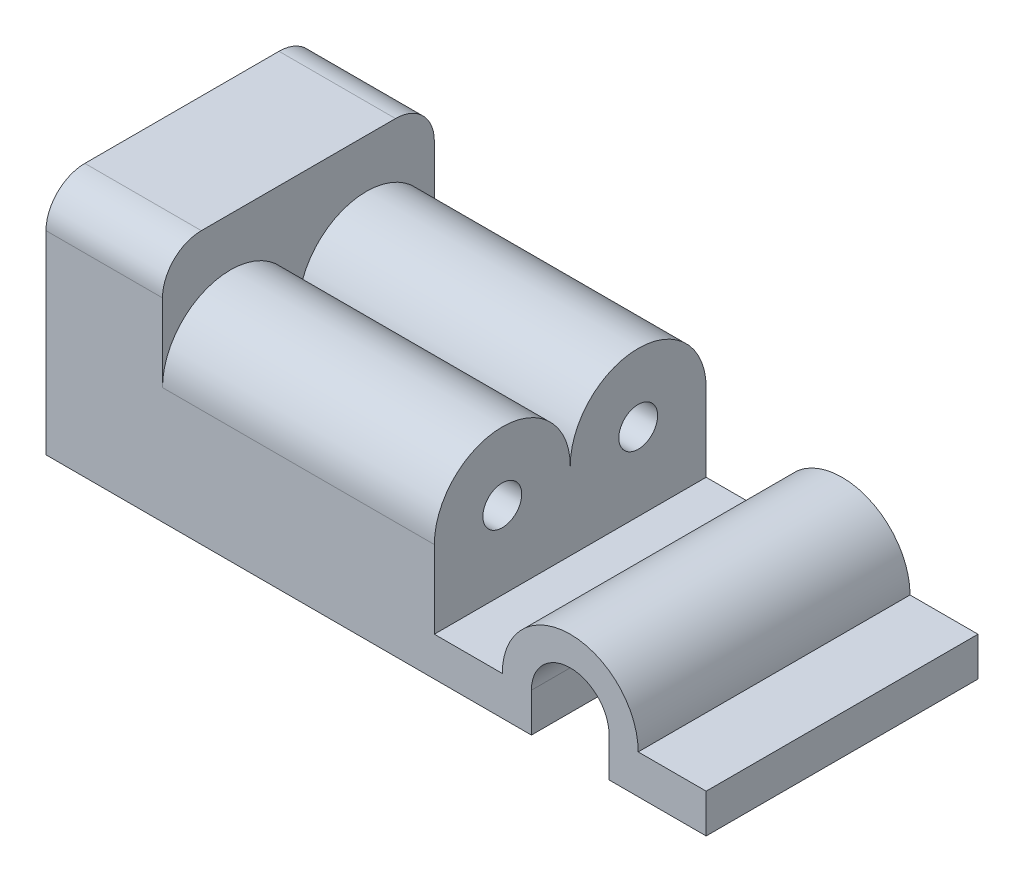
ISO-10303-21;
HEADER;
FILE_DESCRIPTION(('STEP AP214'),'2;1');
FILE_NAME('part.step','',(''),(''),'','','');
FILE_SCHEMA(('AUTOMOTIVE_DESIGN { 1 0 10303 214 1 1 1 1 }'));
ENDSEC;
DATA;
#1=APPLICATION_CONTEXT('core data for automotive mechanical design processes');
#2=APPLICATION_PROTOCOL_DEFINITION('international standard','automotive_design',2000,#1);
#3=PRODUCT_CONTEXT('',#1,'mechanical');
#4=PRODUCT('Part','Part','',(#3));
#5=PRODUCT_RELATED_PRODUCT_CATEGORY('part','',(#4));
#6=PRODUCT_DEFINITION_FORMATION('','',#4);
#7=PRODUCT_DEFINITION_CONTEXT('part definition',#1,'design');
#8=PRODUCT_DEFINITION('design','',#6,#7);
#9=PRODUCT_DEFINITION_SHAPE('','',#8);
#10=(LENGTH_UNIT() NAMED_UNIT(*) SI_UNIT(.MILLI.,.METRE.));
#11=(NAMED_UNIT(*) PLANE_ANGLE_UNIT() SI_UNIT($,.RADIAN.));
#12=(NAMED_UNIT(*) SI_UNIT($,.STERADIAN.) SOLID_ANGLE_UNIT());
#13=UNCERTAINTY_MEASURE_WITH_UNIT(LENGTH_MEASURE(1.E-05),#10,'distance_accuracy_value','');
#14=(GEOMETRIC_REPRESENTATION_CONTEXT(3) GLOBAL_UNCERTAINTY_ASSIGNED_CONTEXT((#13)) GLOBAL_UNIT_ASSIGNED_CONTEXT((#10,
#11,#12)) REPRESENTATION_CONTEXT('',''));
#15=CARTESIAN_POINT('',(0.,0.,0.));
#16=DIRECTION('',(0.,0.,1.));
#17=DIRECTION('',(1.,0.,0.));
#18=AXIS2_PLACEMENT_3D('',#15,#16,#17);
#19=CARTESIAN_POINT('',(-75.1724137931034,-24.3103448275862,35.));
#20=DIRECTION('',(0.,1.,0.));
#21=DIRECTION('',(0.,0.,1.));
#22=AXIS2_PLACEMENT_3D('',#19,#20,#21);
#23=PLANE('',#22);
#24=DIRECTION('',(1.,0.,0.));
#25=VECTOR('',#24,1.);
#26=CARTESIAN_POINT('',(-75.1724137931034,-24.3103448275862,-35.));
#27=LINE('',#26,#25);
#28=CARTESIAN_POINT('',(-75.1724137931034,-24.3103448275862,-35.));
#29=VERTEX_POINT('',#28);
#30=CARTESIAN_POINT('',(49.8275862068966,-24.3103448275862,-35.));
#31=VERTEX_POINT('',#30);
#32=EDGE_CURVE('E254',#29,#31,#27,.T.);
#33=ORIENTED_EDGE('',*,*,#32,.T.);
#34=DIRECTION('',(0.,0.,-1.));
#35=VECTOR('',#34,1.);
#36=CARTESIAN_POINT('',(49.8275862068966,-24.3103448275862,35.));
#37=LINE('',#36,#35);
#38=CARTESIAN_POINT('',(49.8275862068966,-24.3103448275862,35.));
#39=VERTEX_POINT('',#38);
#40=EDGE_CURVE('E210',#39,#31,#37,.T.);
#41=ORIENTED_EDGE('',*,*,#40,.F.);
#42=DIRECTION('',(1.,0.,0.));
#43=VECTOR('',#42,1.);
#44=CARTESIAN_POINT('',(-75.1724137931034,-24.3103448275862,35.));
#45=LINE('',#44,#43);
#46=CARTESIAN_POINT('',(-75.1724137931034,-24.3103448275862,35.));
#47=VERTEX_POINT('',#46);
#48=EDGE_CURVE('E173',#47,#39,#45,.T.);
#49=ORIENTED_EDGE('',*,*,#48,.F.);
#50=DIRECTION('',(0.,0.,-1.));
#51=VECTOR('',#50,1.);
#52=CARTESIAN_POINT('',(-75.1724137931034,-24.3103448275862,35.));
#53=LINE('',#52,#51);
#54=EDGE_CURVE('E177',#47,#29,#53,.T.);
#55=ORIENTED_EDGE('',*,*,#54,.T.);
#56=EDGE_LOOP('',(#33,#41,#49,#55));
#57=FACE_BOUND('',#56,.T.);
#58=ADVANCED_FACE('F33',(#57),#23,.F.);
#59=CARTESIAN_POINT('',(49.8275862068966,-14.3010596020905,35.));
#60=DIRECTION('',(-1.,0.,0.));
#61=DIRECTION('',(0.,0.,1.));
#62=AXIS2_PLACEMENT_3D('',#59,#60,#61);
#63=PLANE('',#62);
#64=DIRECTION('',(0.,1.,0.));
#65=VECTOR('',#64,1.);
#66=CARTESIAN_POINT('',(49.8275862068966,-14.3010596020905,-35.));
#67=LINE('',#66,#65);
#68=CARTESIAN_POINT('',(49.8275862068966,-14.3010596020905,-35.));
#69=VERTEX_POINT('',#68);
#70=EDGE_CURVE('E257',#31,#69,#67,.T.);
#71=ORIENTED_EDGE('',*,*,#70,.T.);
#72=DIRECTION('',(0.,0.,-1.));
#73=VECTOR('',#72,1.);
#74=CARTESIAN_POINT('',(49.8275862068966,-14.3010596020905,35.));
#75=LINE('',#74,#73);
#76=CARTESIAN_POINT('',(49.8275862068966,-14.3010596020905,35.));
#77=VERTEX_POINT('',#76);
#78=EDGE_CURVE('E207',#77,#69,#75,.T.);
#79=ORIENTED_EDGE('',*,*,#78,.F.);
#80=DIRECTION('',(0.,1.,0.));
#81=VECTOR('',#80,1.);
#82=CARTESIAN_POINT('',(49.8275862068966,-14.3010596020905,35.));
#83=LINE('',#82,#81);
#84=EDGE_CURVE('E322',#39,#77,#83,.T.);
#85=ORIENTED_EDGE('',*,*,#84,.F.);
#86=ORIENTED_EDGE('',*,*,#40,.T.);
#87=EDGE_LOOP('',(#71,#79,#85,#86));
#88=FACE_BOUND('',#87,.T.);
#89=ADVANCED_FACE('F321',(#88),#63,.F.);
#90=CARTESIAN_POINT('',(59.8275862068966,-14.3010596020905,35.));
#91=DIRECTION('',(0.,0.,-1.));
#92=DIRECTION('',(-1.,0.,0.));
#93=AXIS2_PLACEMENT_3D('',#90,#91,#92);
#94=CYLINDRICAL_SURFACE('',#93,9.99999999999999);
#95=CARTESIAN_POINT('',(59.8275862068966,-14.3010596020905,-35.));
#96=DIRECTION('',(0.,0.,-1.));
#97=DIRECTION('',(1.,0.,0.));
#98=AXIS2_PLACEMENT_3D('',#95,#96,#97);
#99=CIRCLE('',#98,9.99999999999999);
#100=CARTESIAN_POINT('',(69.8275862068966,-14.3010596020905,-35.));
#101=VERTEX_POINT('',#100);
#102=EDGE_CURVE('E260',#69,#101,#99,.T.);
#103=ORIENTED_EDGE('',*,*,#102,.T.);
#104=DIRECTION('',(0.,0.,-1.));
#105=VECTOR('',#104,1.);
#106=CARTESIAN_POINT('',(69.8275862068966,-14.3010596020905,35.));
#107=LINE('',#106,#105);
#108=CARTESIAN_POINT('',(69.8275862068966,-14.3010596020905,35.));
#109=VERTEX_POINT('',#108);
#110=EDGE_CURVE('E204',#109,#101,#107,.T.);
#111=ORIENTED_EDGE('',*,*,#110,.F.);
#112=CARTESIAN_POINT('',(59.8275862068966,-14.3010596020905,35.));
#113=DIRECTION('',(0.,0.,-1.));
#114=DIRECTION('',(1.,0.,0.));
#115=AXIS2_PLACEMENT_3D('',#112,#113,#114);
#116=CIRCLE('',#115,9.99999999999999);
#117=EDGE_CURVE('E319',#77,#109,#116,.T.);
#118=ORIENTED_EDGE('',*,*,#117,.F.);
#119=ORIENTED_EDGE('',*,*,#78,.T.);
#120=EDGE_LOOP('',(#103,#111,#118,#119));
#121=FACE_BOUND('',#120,.T.);
#122=ADVANCED_FACE('F316',(#121),#94,.F.);
#123=CARTESIAN_POINT('',(69.8275862068966,-24.3103448275862,35.));
#124=DIRECTION('',(1.,0.,0.));
#125=DIRECTION('',(0.,0.,-1.));
#126=AXIS2_PLACEMENT_3D('',#123,#124,#125);
#127=PLANE('',#126);
#128=DIRECTION('',(0.,-1.,0.));
#129=VECTOR('',#128,1.);
#130=CARTESIAN_POINT('',(69.8275862068966,-24.3103448275862,-35.));
#131=LINE('',#130,#129);
#132=CARTESIAN_POINT('',(69.8275862068966,-24.3103448275862,-35.));
#133=VERTEX_POINT('',#132);
#134=EDGE_CURVE('E262',#101,#133,#131,.T.);
#135=ORIENTED_EDGE('',*,*,#134,.T.);
#136=DIRECTION('',(0.,0.,-1.));
#137=VECTOR('',#136,1.);
#138=CARTESIAN_POINT('',(69.8275862068966,-24.3103448275862,35.));
#139=LINE('',#138,#137);
#140=CARTESIAN_POINT('',(69.8275862068966,-24.3103448275862,35.));
#141=VERTEX_POINT('',#140);
#142=EDGE_CURVE('E201',#141,#133,#139,.T.);
#143=ORIENTED_EDGE('',*,*,#142,.F.);
#144=DIRECTION('',(0.,-1.,0.));
#145=VECTOR('',#144,1.);
#146=CARTESIAN_POINT('',(69.8275862068966,-24.3103448275862,35.));
#147=LINE('',#146,#145);
#148=EDGE_CURVE('E311',#109,#141,#147,.T.);
#149=ORIENTED_EDGE('',*,*,#148,.F.);
#150=ORIENTED_EDGE('',*,*,#110,.T.);
#151=EDGE_LOOP('',(#135,#143,#149,#150));
#152=FACE_BOUND('',#151,.T.);
#153=ADVANCED_FACE('F310',(#152),#127,.F.);
#154=CARTESIAN_POINT('',(94.8275862068966,-24.3103448275862,35.));
#155=DIRECTION('',(0.,1.,0.));
#156=DIRECTION('',(0.,0.,1.));
#157=AXIS2_PLACEMENT_3D('',#154,#155,#156);
#158=PLANE('',#157);
#159=DIRECTION('',(1.,0.,0.));
#160=VECTOR('',#159,1.);
#161=CARTESIAN_POINT('',(94.8275862068966,-24.3103448275862,-35.));
#162=LINE('',#161,#160);
#163=CARTESIAN_POINT('',(94.8275862068966,-24.3103448275862,-35.));
#164=VERTEX_POINT('',#163);
#165=EDGE_CURVE('E264',#133,#164,#162,.T.);
#166=ORIENTED_EDGE('',*,*,#165,.T.);
#167=DIRECTION('',(0.,0.,-1.));
#168=VECTOR('',#167,1.);
#169=CARTESIAN_POINT('',(94.8275862068966,-24.3103448275862,35.));
#170=LINE('',#169,#168);
#171=CARTESIAN_POINT('',(94.8275862068966,-24.3103448275862,35.));
#172=VERTEX_POINT('',#171);
#173=EDGE_CURVE('E198',#172,#164,#170,.T.);
#174=ORIENTED_EDGE('',*,*,#173,.F.);
#175=DIRECTION('',(1.,0.,0.));
#176=VECTOR('',#175,1.);
#177=CARTESIAN_POINT('',(94.8275862068966,-24.3103448275862,35.));
#178=LINE('',#177,#176);
#179=EDGE_CURVE('E306',#141,#172,#178,.T.);
#180=ORIENTED_EDGE('',*,*,#179,.F.);
#181=ORIENTED_EDGE('',*,*,#142,.T.);
#182=EDGE_LOOP('',(#166,#174,#180,#181));
#183=FACE_BOUND('',#182,.T.);
#184=ADVANCED_FACE('F305',(#183),#158,.F.);
#185=CARTESIAN_POINT('',(94.8275862068966,-14.3103448275862,35.));
#186=DIRECTION('',(-1.,0.,0.));
#187=DIRECTION('',(0.,0.,1.));
#188=AXIS2_PLACEMENT_3D('',#185,#186,#187);
#189=PLANE('',#188);
#190=DIRECTION('',(0.,1.,0.));
#191=VECTOR('',#190,1.);
#192=CARTESIAN_POINT('',(94.8275862068966,-14.3103448275862,-35.));
#193=LINE('',#192,#191);
#194=CARTESIAN_POINT('',(94.8275862068966,-14.3103448275862,-35.));
#195=VERTEX_POINT('',#194);
#196=EDGE_CURVE('E266',#164,#195,#193,.T.);
#197=ORIENTED_EDGE('',*,*,#196,.T.);
#198=DIRECTION('',(0.,0.,-1.));
#199=VECTOR('',#198,1.);
#200=CARTESIAN_POINT('',(94.8275862068966,-14.3103448275862,35.));
#201=LINE('',#200,#199);
#202=CARTESIAN_POINT('',(94.8275862068966,-14.3103448275862,35.));
#203=VERTEX_POINT('',#202);
#204=EDGE_CURVE('E195',#203,#195,#201,.T.);
#205=ORIENTED_EDGE('',*,*,#204,.F.);
#206=DIRECTION('',(0.,1.,0.));
#207=VECTOR('',#206,1.);
#208=CARTESIAN_POINT('',(94.8275862068966,-14.3103448275862,35.));
#209=LINE('',#208,#207);
#210=EDGE_CURVE('E302',#172,#203,#209,.T.);
#211=ORIENTED_EDGE('',*,*,#210,.F.);
#212=ORIENTED_EDGE('',*,*,#173,.T.);
#213=EDGE_LOOP('',(#197,#205,#211,#212));
#214=FACE_BOUND('',#213,.T.);
#215=ADVANCED_FACE('F299',(#214),#189,.F.);
#216=CARTESIAN_POINT('',(77.3275837435989,-14.3103448275862,35.));
#217=DIRECTION('',(0.,-1.,0.));
#218=DIRECTION('',(0.,0.,-1.));
#219=AXIS2_PLACEMENT_3D('',#216,#217,#218);
#220=PLANE('',#219);
#221=DIRECTION('',(-1.,0.,0.));
#222=VECTOR('',#221,1.);
#223=CARTESIAN_POINT('',(77.3275837435989,-14.3103448275862,-35.));
#224=LINE('',#223,#222);
#225=CARTESIAN_POINT('',(77.3275837435989,-14.3103448275862,-35.));
#226=VERTEX_POINT('',#225);
#227=EDGE_CURVE('E268',#195,#226,#224,.T.);
#228=ORIENTED_EDGE('',*,*,#227,.T.);
#229=DIRECTION('',(0.,0.,-1.));
#230=VECTOR('',#229,1.);
#231=CARTESIAN_POINT('',(77.3275837435989,-14.3103448275862,35.));
#232=LINE('',#231,#230);
#233=CARTESIAN_POINT('',(77.3275837435989,-14.3103448275862,35.));
#234=VERTEX_POINT('',#233);
#235=EDGE_CURVE('E192',#234,#226,#232,.T.);
#236=ORIENTED_EDGE('',*,*,#235,.F.);
#237=DIRECTION('',(-1.,0.,0.));
#238=VECTOR('',#237,1.);
#239=CARTESIAN_POINT('',(77.3275837435989,-14.3103448275862,35.));
#240=LINE('',#239,#238);
#241=EDGE_CURVE('E293',#203,#234,#240,.T.);
#242=ORIENTED_EDGE('',*,*,#241,.F.);
#243=ORIENTED_EDGE('',*,*,#204,.T.);
#244=EDGE_LOOP('',(#228,#236,#242,#243));
#245=FACE_BOUND('',#244,.T.);
#246=ADVANCED_FACE('F292',(#245),#220,.F.);
#247=CARTESIAN_POINT('',(59.8275862068966,-14.3010596020905,35.));
#248=DIRECTION('',(0.,0.,-1.));
#249=DIRECTION('',(-1.,0.,0.));
#250=AXIS2_PLACEMENT_3D('',#247,#248,#249);
#251=CYLINDRICAL_SURFACE('',#250,17.5);
#252=CARTESIAN_POINT('',(59.8275862068966,-14.3010596020905,-35.));
#253=DIRECTION('',(0.,0.,1.));
#254=DIRECTION('',(-1.,0.,0.));
#255=AXIS2_PLACEMENT_3D('',#252,#253,#254);
#256=CIRCLE('',#255,17.5);
#257=CARTESIAN_POINT('',(42.3275886701942,-14.3103448275862,-35.));
#258=VERTEX_POINT('',#257);
#259=EDGE_CURVE('E270',#226,#258,#256,.T.);
#260=ORIENTED_EDGE('',*,*,#259,.T.);
#261=DIRECTION('',(0.,0.,-1.));
#262=VECTOR('',#261,1.);
#263=CARTESIAN_POINT('',(42.3275886701942,-14.3103448275862,35.));
#264=LINE('',#263,#262);
#265=CARTESIAN_POINT('',(42.3275886701942,-14.3103448275862,35.));
#266=VERTEX_POINT('',#265);
#267=EDGE_CURVE('E189',#266,#258,#264,.T.);
#268=ORIENTED_EDGE('',*,*,#267,.F.);
#269=CARTESIAN_POINT('',(59.8275862068966,-14.3010596020905,35.));
#270=DIRECTION('',(0.,0.,1.));
#271=DIRECTION('',(-1.,0.,0.));
#272=AXIS2_PLACEMENT_3D('',#269,#270,#271);
#273=CIRCLE('',#272,17.5);
#274=EDGE_CURVE('E288',#234,#266,#273,.T.);
#275=ORIENTED_EDGE('',*,*,#274,.F.);
#276=ORIENTED_EDGE('',*,*,#235,.T.);
#277=EDGE_LOOP('',(#260,#268,#275,#276));
#278=FACE_BOUND('',#277,.T.);
#279=ADVANCED_FACE('F287',(#278),#251,.T.);
#280=CARTESIAN_POINT('',(24.8275862068966,-14.3103448275862,35.));
#281=DIRECTION('',(0.,-1.,0.));
#282=DIRECTION('',(1.,0.,0.));
#283=AXIS2_PLACEMENT_3D('',#280,#281,#282);
#284=PLANE('',#283);
#285=DIRECTION('',(-1.,0.,0.));
#286=VECTOR('',#285,1.);
#287=CARTESIAN_POINT('',(24.8275862068966,-14.3103448275862,-35.));
#288=LINE('',#287,#286);
#289=CARTESIAN_POINT('',(24.8275862068966,-14.3103448275862,-35.));
#290=VERTEX_POINT('',#289);
#291=EDGE_CURVE('E272',#258,#290,#288,.T.);
#292=ORIENTED_EDGE('',*,*,#291,.T.);
#293=DIRECTION('',(0.,0.,-1.));
#294=VECTOR('',#293,1.);
#295=CARTESIAN_POINT('',(24.8275862068966,-14.3103448275862,35.));
#296=LINE('',#295,#294);
#297=CARTESIAN_POINT('',(24.8275862068966,-14.3103448275862,35.));
#298=VERTEX_POINT('',#297);
#299=EDGE_CURVE('E186',#298,#290,#296,.T.);
#300=ORIENTED_EDGE('',*,*,#299,.F.);
#301=DIRECTION('',(-1.,0.,0.));
#302=VECTOR('',#301,1.);
#303=CARTESIAN_POINT('',(24.8275862068966,-14.3103448275862,35.));
#304=LINE('',#303,#302);
#305=EDGE_CURVE('E284',#266,#298,#304,.T.);
#306=ORIENTED_EDGE('',*,*,#305,.F.);
#307=ORIENTED_EDGE('',*,*,#267,.T.);
#308=EDGE_LOOP('',(#292,#300,#306,#307));
#309=FACE_BOUND('',#308,.T.);
#310=ADVANCED_FACE('F281',(#309),#284,.F.);
#311=CARTESIAN_POINT('',(24.8275862068966,5.68965517241379,35.));
#312=DIRECTION('',(-1.,0.,0.));
#313=DIRECTION('',(0.,-1.,0.));
#314=AXIS2_PLACEMENT_3D('',#311,#312,#313);
#315=PLANE('',#314);
#316=CARTESIAN_POINT('',(24.8275862068966,5.6896551724138,-17.5));
#317=DIRECTION('',(1.,0.,0.));
#318=DIRECTION('',(0.,1.,0.));
#319=AXIS2_PLACEMENT_3D('',#316,#317,#318);
#320=CIRCLE('',#319,5.);
#321=CARTESIAN_POINT('',(24.8275862068966,10.6896551724138,-17.5));
#322=VERTEX_POINT('',#321);
#323=EDGE_CURVE('E391',#322,#322,#320,.T.);
#324=ORIENTED_EDGE('',*,*,#323,.F.);
#325=EDGE_LOOP('',(#324));
#326=FACE_BOUND('',#325,.T.);
#327=CARTESIAN_POINT('',(24.8275862068966,5.6896551724138,17.5));
#328=DIRECTION('',(1.,0.,0.));
#329=DIRECTION('',(0.,1.,0.));
#330=AXIS2_PLACEMENT_3D('',#327,#328,#329);
#331=CIRCLE('',#330,5.);
#332=CARTESIAN_POINT('',(24.8275862068966,10.6896551724138,17.5));
#333=VERTEX_POINT('',#332);
#334=EDGE_CURVE('E390',#333,#333,#331,.T.);
#335=ORIENTED_EDGE('',*,*,#334,.F.);
#336=EDGE_LOOP('',(#335));
#337=FACE_BOUND('',#336,.T.);
#338=DIRECTION('',(0.,1.,0.));
#339=VECTOR('',#338,1.);
#340=CARTESIAN_POINT('',(24.8275862068966,5.68965517241379,-35.));
#341=LINE('',#340,#339);
#342=CARTESIAN_POINT('',(24.8275862068966,5.68965517241379,-35.));
#343=VERTEX_POINT('',#342);
#344=EDGE_CURVE('E160',#290,#343,#341,.T.);
#345=ORIENTED_EDGE('',*,*,#344,.T.);
#346=CARTESIAN_POINT('',(24.8275862068966,5.68965517241379,-17.5));
#347=DIRECTION('',(1.,0.,0.));
#348=DIRECTION('',(0.,0.,-1.));
#349=AXIS2_PLACEMENT_3D('',#346,#347,#348);
#350=CIRCLE('',#349,17.5);
#351=CARTESIAN_POINT('',(24.8275862068966,5.68965517241379,0.));
#352=VERTEX_POINT('',#351);
#353=EDGE_CURVE('E156',#343,#352,#350,.T.);
#354=ORIENTED_EDGE('',*,*,#353,.T.);
#355=CARTESIAN_POINT('',(24.8275862068966,5.68965517241379,17.5));
#356=DIRECTION('',(1.,0.,0.));
#357=DIRECTION('',(0.,0.,-1.));
#358=AXIS2_PLACEMENT_3D('',#355,#356,#357);
#359=CIRCLE('',#358,17.5);
#360=CARTESIAN_POINT('',(24.8275862068966,5.68965517241379,35.));
#361=VERTEX_POINT('',#360);
#362=EDGE_CURVE('E401',#352,#361,#359,.T.);
#363=ORIENTED_EDGE('',*,*,#362,.T.);
#364=DIRECTION('',(0.,1.,0.));
#365=VECTOR('',#364,1.);
#366=CARTESIAN_POINT('',(24.8275862068966,5.68965517241379,35.));
#367=LINE('',#366,#365);
#368=EDGE_CURVE('E250',#298,#361,#367,.T.);
#369=ORIENTED_EDGE('',*,*,#368,.F.);
#370=ORIENTED_EDGE('',*,*,#299,.T.);
#371=EDGE_LOOP('',(#345,#354,#363,#369,#370));
#372=FACE_BOUND('',#371,.T.);
#373=ADVANCED_FACE('F274',(#326,#337,#372),#315,.F.);
#374=CARTESIAN_POINT('',(-45.1724137931034,35.6896551724138,35.));
#375=DIRECTION('',(-1.,0.,0.));
#376=DIRECTION('',(0.,0.,1.));
#377=AXIS2_PLACEMENT_3D('',#374,#375,#376);
#378=PLANE('',#377);
#379=CARTESIAN_POINT('',(-45.1724137931034,5.68965517241379,-17.5));
#380=DIRECTION('',(1.,0.,0.));
#381=DIRECTION('',(0.,0.,-1.));
#382=AXIS2_PLACEMENT_3D('',#379,#380,#381);
#383=CIRCLE('',#382,17.5);
#384=CARTESIAN_POINT('',(-45.1724137931034,5.68965517241379,-35.));
#385=VERTEX_POINT('',#384);
#386=CARTESIAN_POINT('',(-45.1724137931034,5.68965517241379,0.));
#387=VERTEX_POINT('',#386);
#388=EDGE_CURVE('E154',#385,#387,#383,.T.);
#389=ORIENTED_EDGE('',*,*,#388,.F.);
#390=DIRECTION('',(0.,1.,0.));
#391=VECTOR('',#390,1.);
#392=CARTESIAN_POINT('',(-45.1724137931034,35.6896551724138,-35.));
#393=LINE('',#392,#391);
#394=CARTESIAN_POINT('',(-45.1724137931034,25.6896551724138,-35.));
#395=VERTEX_POINT('',#394);
#396=EDGE_CURVE('E159',#385,#395,#393,.T.);
#397=ORIENTED_EDGE('',*,*,#396,.T.);
#398=CARTESIAN_POINT('',(-45.1724137931034,25.6896551724138,-25.));
#399=DIRECTION('',(-1.,0.,0.));
#400=DIRECTION('',(0.,0.,1.));
#401=AXIS2_PLACEMENT_3D('',#398,#399,#400);
#402=CIRCLE('',#401,10.);
#403=CARTESIAN_POINT('',(-45.1724137931034,35.6896551724138,-25.));
#404=VERTEX_POINT('',#403);
#405=EDGE_CURVE('E11',#395,#404,#402,.F.);
#406=ORIENTED_EDGE('',*,*,#405,.T.);
#407=DIRECTION('',(0.,0.,-1.));
#408=VECTOR('',#407,1.);
#409=CARTESIAN_POINT('',(-45.1724137931034,35.6896551724138,35.));
#410=LINE('',#409,#408);
#411=CARTESIAN_POINT('',(-45.1724137931034,35.6896551724138,25.));
#412=VERTEX_POINT('',#411);
#413=EDGE_CURVE('E183',#412,#404,#410,.T.);
#414=ORIENTED_EDGE('',*,*,#413,.F.);
#415=CARTESIAN_POINT('',(-45.1724137931034,25.6896551724138,25.));
#416=DIRECTION('',(-1.,0.,0.));
#417=DIRECTION('',(0.,0.,1.));
#418=AXIS2_PLACEMENT_3D('',#415,#416,#417);
#419=CIRCLE('',#418,10.);
#420=CARTESIAN_POINT('',(-45.1724137931034,25.6896551724138,35.));
#421=VERTEX_POINT('',#420);
#422=EDGE_CURVE('E220',#412,#421,#419,.F.);
#423=ORIENTED_EDGE('',*,*,#422,.T.);
#424=DIRECTION('',(0.,1.,0.));
#425=VECTOR('',#424,1.);
#426=CARTESIAN_POINT('',(-45.1724137931034,35.6896551724138,35.));
#427=LINE('',#426,#425);
#428=CARTESIAN_POINT('',(-45.1724137931034,5.68965517241379,35.));
#429=VERTEX_POINT('',#428);
#430=EDGE_CURVE('E244',#429,#421,#427,.T.);
#431=ORIENTED_EDGE('',*,*,#430,.F.);
#432=CARTESIAN_POINT('',(-45.1724137931034,5.68965517241379,17.5));
#433=DIRECTION('',(1.,0.,0.));
#434=DIRECTION('',(0.,0.,-1.));
#435=AXIS2_PLACEMENT_3D('',#432,#433,#434);
#436=CIRCLE('',#435,17.5);
#437=EDGE_CURVE('E167',#387,#429,#436,.T.);
#438=ORIENTED_EDGE('',*,*,#437,.F.);
#439=EDGE_LOOP('',(#389,#397,#406,#414,#423,#431,#438));
#440=FACE_BOUND('',#439,.T.);
#441=ADVANCED_FACE('F164',(#440),#378,.F.);
#442=CARTESIAN_POINT('',(-75.1724137931034,35.6896551724138,35.));
#443=DIRECTION('',(0.,-1.,0.));
#444=DIRECTION('',(0.,0.,-1.));
#445=AXIS2_PLACEMENT_3D('',#442,#443,#444);
#446=PLANE('',#445);
#447=ORIENTED_EDGE('',*,*,#413,.T.);
#448=DIRECTION('',(-1.,0.,0.));
#449=VECTOR('',#448,1.);
#450=CARTESIAN_POINT('',(-75.1724137931034,35.6896551724138,-25.));
#451=LINE('',#450,#449);
#452=CARTESIAN_POINT('',(-75.1724137931034,35.6896551724138,-25.));
#453=VERTEX_POINT('',#452);
#454=EDGE_CURVE('E222',#404,#453,#451,.T.);
#455=ORIENTED_EDGE('',*,*,#454,.T.);
#456=DIRECTION('',(0.,0.,-1.));
#457=VECTOR('',#456,1.);
#458=CARTESIAN_POINT('',(-75.1724137931034,35.6896551724138,35.));
#459=LINE('',#458,#457);
#460=CARTESIAN_POINT('',(-75.1724137931034,35.6896551724138,25.));
#461=VERTEX_POINT('',#460);
#462=EDGE_CURVE('E180',#461,#453,#459,.T.);
#463=ORIENTED_EDGE('',*,*,#462,.F.);
#464=DIRECTION('',(-1.,0.,0.));
#465=VECTOR('',#464,1.);
#466=CARTESIAN_POINT('',(-45.1724137931034,35.6896551724138,25.));
#467=LINE('',#466,#465);
#468=EDGE_CURVE('E218',#461,#412,#467,.F.);
#469=ORIENTED_EDGE('',*,*,#468,.T.);
#470=EDGE_LOOP('',(#447,#455,#463,#469));
#471=FACE_BOUND('',#470,.T.);
#472=ADVANCED_FACE('F228',(#471),#446,.F.);
#473=CARTESIAN_POINT('',(-75.1724137931034,-24.3103448275862,35.));
#474=DIRECTION('',(1.,0.,0.));
#475=DIRECTION('',(0.,0.,-1.));
#476=AXIS2_PLACEMENT_3D('',#473,#474,#475);
#477=PLANE('',#476);
#478=ORIENTED_EDGE('',*,*,#462,.T.);
#479=CARTESIAN_POINT('',(-75.1724137931034,25.6896551724138,-25.));
#480=DIRECTION('',(1.,0.,0.));
#481=DIRECTION('',(0.,0.,-1.));
#482=AXIS2_PLACEMENT_3D('',#479,#480,#481);
#483=CIRCLE('',#482,10.);
#484=CARTESIAN_POINT('',(-75.1724137931034,25.6896551724138,-35.));
#485=VERTEX_POINT('',#484);
#486=EDGE_CURVE('E55',#453,#485,#483,.F.);
#487=ORIENTED_EDGE('',*,*,#486,.T.);
#488=DIRECTION('',(0.,-1.,0.));
#489=VECTOR('',#488,1.);
#490=CARTESIAN_POINT('',(-75.1724137931034,-24.3103448275862,-35.));
#491=LINE('',#490,#489);
#492=EDGE_CURVE('E171',#485,#29,#491,.T.);
#493=ORIENTED_EDGE('',*,*,#492,.T.);
#494=ORIENTED_EDGE('',*,*,#54,.F.);
#495=DIRECTION('',(0.,-1.,0.));
#496=VECTOR('',#495,1.);
#497=CARTESIAN_POINT('',(-75.1724137931034,-24.3103448275862,35.));
#498=LINE('',#497,#496);
#499=CARTESIAN_POINT('',(-75.1724137931034,25.6896551724138,35.));
#500=VERTEX_POINT('',#499);
#501=EDGE_CURVE('E181',#500,#47,#498,.T.);
#502=ORIENTED_EDGE('',*,*,#501,.F.);
#503=CARTESIAN_POINT('',(-75.1724137931034,25.6896551724138,25.));
#504=DIRECTION('',(1.,0.,0.));
#505=DIRECTION('',(0.,0.,-1.));
#506=AXIS2_PLACEMENT_3D('',#503,#504,#505);
#507=CIRCLE('',#506,10.);
#508=EDGE_CURVE('E216',#500,#461,#507,.F.);
#509=ORIENTED_EDGE('',*,*,#508,.T.);
#510=EDGE_LOOP('',(#478,#487,#493,#494,#502,#509));
#511=FACE_BOUND('',#510,.T.);
#512=ADVANCED_FACE('F232',(#511),#477,.F.);
#513=CARTESIAN_POINT('',(59.8275862068966,-14.3010596020905,35.));
#514=DIRECTION('',(0.,0.,1.));
#515=DIRECTION('',(1.,0.,0.));
#516=AXIS2_PLACEMENT_3D('',#513,#514,#515);
#517=PLANE('',#516);
#518=ORIENTED_EDGE('',*,*,#430,.T.);
#519=DIRECTION('',(-1.,0.,0.));
#520=VECTOR('',#519,1.);
#521=CARTESIAN_POINT('',(-75.1724137931034,25.6896551724138,35.));
#522=LINE('',#521,#520);
#523=EDGE_CURVE('E213',#421,#500,#522,.T.);
#524=ORIENTED_EDGE('',*,*,#523,.T.);
#525=ORIENTED_EDGE('',*,*,#501,.T.);
#526=ORIENTED_EDGE('',*,*,#48,.T.);
#527=ORIENTED_EDGE('',*,*,#84,.T.);
#528=ORIENTED_EDGE('',*,*,#117,.T.);
#529=ORIENTED_EDGE('',*,*,#148,.T.);
#530=ORIENTED_EDGE('',*,*,#179,.T.);
#531=ORIENTED_EDGE('',*,*,#210,.T.);
#532=ORIENTED_EDGE('',*,*,#241,.T.);
#533=ORIENTED_EDGE('',*,*,#274,.T.);
#534=ORIENTED_EDGE('',*,*,#305,.T.);
#535=ORIENTED_EDGE('',*,*,#368,.T.);
#536=DIRECTION('',(-1.,0.,0.));
#537=VECTOR('',#536,1.);
#538=CARTESIAN_POINT('',(-45.1724137931034,5.68965517241379,35.));
#539=LINE('',#538,#537);
#540=EDGE_CURVE('E247',#361,#429,#539,.T.);
#541=ORIENTED_EDGE('',*,*,#540,.T.);
#542=EDGE_LOOP('',(#518,#524,#525,#526,#527,#528,#529,#530,#531,#532,#533,#534,#535,#541));
#543=FACE_BOUND('',#542,.T.);
#544=ADVANCED_FACE('F241',(#543),#517,.T.);
#545=CARTESIAN_POINT('',(59.8275862068966,-14.3010596020905,-35.));
#546=DIRECTION('',(0.,0.,1.));
#547=DIRECTION('',(1.,0.,0.));
#548=AXIS2_PLACEMENT_3D('',#545,#546,#547);
#549=PLANE('',#548);
#550=ORIENTED_EDGE('',*,*,#492,.F.);
#551=DIRECTION('',(-1.,0.,0.));
#552=VECTOR('',#551,1.);
#553=CARTESIAN_POINT('',(59.8275862068966,25.6896551724138,-35.));
#554=LINE('',#553,#552);
#555=EDGE_CURVE('E41',#485,#395,#554,.F.);
#556=ORIENTED_EDGE('',*,*,#555,.T.);
#557=ORIENTED_EDGE('',*,*,#396,.F.);
#558=DIRECTION('',(-1.,0.,0.));
#559=VECTOR('',#558,1.);
#560=CARTESIAN_POINT('',(-45.1724137931034,5.68965517241379,-35.));
#561=LINE('',#560,#559);
#562=EDGE_CURVE('E150',#343,#385,#561,.T.);
#563=ORIENTED_EDGE('',*,*,#562,.F.);
#564=ORIENTED_EDGE('',*,*,#344,.F.);
#565=ORIENTED_EDGE('',*,*,#291,.F.);
#566=ORIENTED_EDGE('',*,*,#259,.F.);
#567=ORIENTED_EDGE('',*,*,#227,.F.);
#568=ORIENTED_EDGE('',*,*,#196,.F.);
#569=ORIENTED_EDGE('',*,*,#165,.F.);
#570=ORIENTED_EDGE('',*,*,#134,.F.);
#571=ORIENTED_EDGE('',*,*,#102,.F.);
#572=ORIENTED_EDGE('',*,*,#70,.F.);
#573=ORIENTED_EDGE('',*,*,#32,.F.);
#574=EDGE_LOOP('',(#550,#556,#557,#563,#564,#565,#566,#567,#568,#569,#570,#571,#572,#573));
#575=FACE_BOUND('',#574,.T.);
#576=ADVANCED_FACE('F170',(#575),#549,.F.);
#577=CARTESIAN_POINT('',(59.8275862068966,25.6896551724138,25.));
#578=DIRECTION('',(1.,0.,0.));
#579=DIRECTION('',(0.,0.,-1.));
#580=AXIS2_PLACEMENT_3D('',#577,#578,#579);
#581=CYLINDRICAL_SURFACE('',#580,10.);
#582=ORIENTED_EDGE('',*,*,#422,.F.);
#583=ORIENTED_EDGE('',*,*,#468,.F.);
#584=ORIENTED_EDGE('',*,*,#508,.F.);
#585=ORIENTED_EDGE('',*,*,#523,.F.);
#586=EDGE_LOOP('',(#582,#583,#584,#585));
#587=FACE_BOUND('',#586,.T.);
#588=ADVANCED_FACE('F238',(#587),#581,.T.);
#589=CARTESIAN_POINT('',(-75.1724137931034,25.6896551724138,-25.));
#590=DIRECTION('',(-1.,0.,0.));
#591=DIRECTION('',(0.,0.,1.));
#592=AXIS2_PLACEMENT_3D('',#589,#590,#591);
#593=CYLINDRICAL_SURFACE('',#592,10.);
#594=ORIENTED_EDGE('',*,*,#405,.F.);
#595=ORIENTED_EDGE('',*,*,#555,.F.);
#596=ORIENTED_EDGE('',*,*,#486,.F.);
#597=ORIENTED_EDGE('',*,*,#454,.F.);
#598=EDGE_LOOP('',(#594,#595,#596,#597));
#599=FACE_BOUND('',#598,.T.);
#600=ADVANCED_FACE('F35',(#599),#593,.T.);
#601=CARTESIAN_POINT('',(24.8275862068966,5.68965517241379,17.5));
#602=DIRECTION('',(-1.,0.,0.));
#603=DIRECTION('',(0.,0.,1.));
#604=AXIS2_PLACEMENT_3D('',#601,#602,#603);
#605=CYLINDRICAL_SURFACE('',#604,17.5);
#606=ORIENTED_EDGE('',*,*,#437,.T.);
#607=ORIENTED_EDGE('',*,*,#540,.F.);
#608=ORIENTED_EDGE('',*,*,#362,.F.);
#609=DIRECTION('',(-1.,0.,0.));
#610=VECTOR('',#609,1.);
#611=CARTESIAN_POINT('',(24.8275862068966,5.68965517241379,0.));
#612=LINE('',#611,#610);
#613=EDGE_CURVE('E258',#352,#387,#612,.T.);
#614=ORIENTED_EDGE('',*,*,#613,.T.);
#615=EDGE_LOOP('',(#606,#607,#608,#614));
#616=FACE_BOUND('',#615,.T.);
#617=ADVANCED_FACE('F327',(#616),#605,.T.);
#618=CARTESIAN_POINT('',(24.8275862068966,5.68965517241379,-17.5));
#619=DIRECTION('',(-1.,0.,0.));
#620=DIRECTION('',(0.,0.,1.));
#621=AXIS2_PLACEMENT_3D('',#618,#619,#620);
#622=CYLINDRICAL_SURFACE('',#621,17.5);
#623=ORIENTED_EDGE('',*,*,#388,.T.);
#624=ORIENTED_EDGE('',*,*,#613,.F.);
#625=ORIENTED_EDGE('',*,*,#353,.F.);
#626=ORIENTED_EDGE('',*,*,#562,.T.);
#627=EDGE_LOOP('',(#623,#624,#625,#626));
#628=FACE_BOUND('',#627,.T.);
#629=ADVANCED_FACE('F152',(#628),#622,.T.);
#630=CARTESIAN_POINT('',(-45.1724137931034,5.68965517241379,17.5));
#631=DIRECTION('',(1.,0.,0.));
#632=DIRECTION('',(0.,1.,0.));
#633=AXIS2_PLACEMENT_3D('',#630,#631,#632);
#634=CYLINDRICAL_SURFACE('',#633,5.);
#635=CARTESIAN_POINT('',(-45.1724137931034,5.68965517241379,17.5));
#636=DIRECTION('',(1.,0.,0.));
#637=DIRECTION('',(0.,1.,0.));
#638=AXIS2_PLACEMENT_3D('',#635,#636,#637);
#639=CIRCLE('',#638,5.);
#640=CARTESIAN_POINT('',(-45.1724137931034,10.6896551724138,17.5));
#641=VERTEX_POINT('',#640);
#642=EDGE_CURVE('E168',#641,#641,#639,.T.);
#643=ORIENTED_EDGE('',*,*,#642,.F.);
#644=EDGE_LOOP('',(#643));
#645=FACE_BOUND('',#644,.T.);
#646=ORIENTED_EDGE('',*,*,#334,.T.);
#647=EDGE_LOOP('',(#646));
#648=FACE_BOUND('',#647,.T.);
#649=ADVANCED_FACE('F370',(#645,#648),#634,.F.);
#650=CARTESIAN_POINT('',(-45.1724137931034,5.68965517241379,17.5));
#651=DIRECTION('',(1.,0.,0.));
#652=DIRECTION('',(0.,1.,0.));
#653=AXIS2_PLACEMENT_3D('',#650,#651,#652);
#654=PLANE('',#653);
#655=ORIENTED_EDGE('',*,*,#642,.T.);
#656=EDGE_LOOP('',(#655));
#657=FACE_BOUND('',#656,.T.);
#658=ADVANCED_FACE('F373',(#657),#654,.T.);
#659=CARTESIAN_POINT('',(-45.1724137931034,5.68965517241379,-17.5));
#660=DIRECTION('',(1.,0.,0.));
#661=DIRECTION('',(0.,1.,0.));
#662=AXIS2_PLACEMENT_3D('',#659,#660,#661);
#663=CYLINDRICAL_SURFACE('',#662,5.);
#664=CARTESIAN_POINT('',(-45.1724137931034,5.68965517241379,-17.5));
#665=DIRECTION('',(1.,0.,0.));
#666=DIRECTION('',(0.,1.,0.));
#667=AXIS2_PLACEMENT_3D('',#664,#665,#666);
#668=CIRCLE('',#667,5.);
#669=CARTESIAN_POINT('',(-45.1724137931034,10.6896551724138,-17.5));
#670=VERTEX_POINT('',#669);
#671=EDGE_CURVE('E389',#670,#670,#668,.T.);
#672=ORIENTED_EDGE('',*,*,#671,.F.);
#673=EDGE_LOOP('',(#672));
#674=FACE_BOUND('',#673,.T.);
#675=ORIENTED_EDGE('',*,*,#323,.T.);
#676=EDGE_LOOP('',(#675));
#677=FACE_BOUND('',#676,.T.);
#678=ADVANCED_FACE('F377',(#674,#677),#663,.F.);
#679=CARTESIAN_POINT('',(-45.1724137931034,5.68965517241379,-17.5));
#680=DIRECTION('',(1.,0.,0.));
#681=DIRECTION('',(0.,1.,0.));
#682=AXIS2_PLACEMENT_3D('',#679,#680,#681);
#683=PLANE('',#682);
#684=ORIENTED_EDGE('',*,*,#671,.T.);
#685=EDGE_LOOP('',(#684));
#686=FACE_BOUND('',#685,.T.);
#687=ADVANCED_FACE('F381',(#686),#683,.T.);
#688=CLOSED_SHELL('',(#58,#89,#122,#153,#184,#215,#246,#279,#310,#373,#441,#472,#512,#544,#576,
#588,#600,#617,#629,#649,#658,#678,#687));
#689=MANIFOLD_SOLID_BREP('B2',#688);
#690=ADVANCED_BREP_SHAPE_REPRESENTATION('',(#18,#689),#14);
#691=SHAPE_DEFINITION_REPRESENTATION(#9,#690);
ENDSEC;
END-ISO-10303-21;
